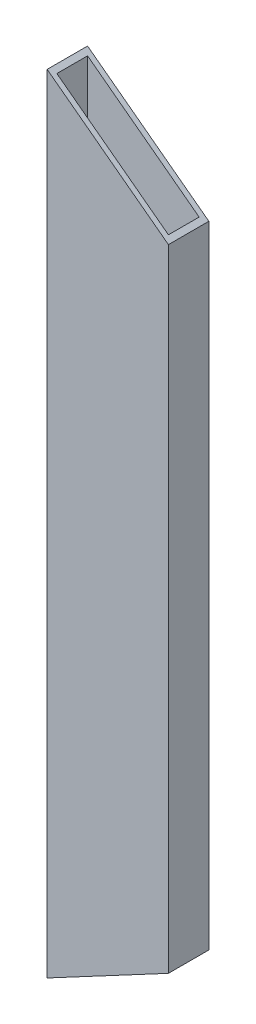
ISO-10303-21;
HEADER;
FILE_DESCRIPTION(('STEP AP214'),'2;1');
FILE_NAME('part.step','',(''),(''),'','','');
FILE_SCHEMA(('AUTOMOTIVE_DESIGN { 1 0 10303 214 1 1 1 1 }'));
ENDSEC;
DATA;
#1=APPLICATION_CONTEXT('core data for automotive mechanical design processes');
#2=APPLICATION_PROTOCOL_DEFINITION('international standard','automotive_design',2000,#1);
#3=PRODUCT_CONTEXT('',#1,'mechanical');
#4=PRODUCT('Part','Part','',(#3));
#5=PRODUCT_RELATED_PRODUCT_CATEGORY('part','',(#4));
#6=PRODUCT_DEFINITION_FORMATION('','',#4);
#7=PRODUCT_DEFINITION_CONTEXT('part definition',#1,'design');
#8=PRODUCT_DEFINITION('design','',#6,#7);
#9=PRODUCT_DEFINITION_SHAPE('','',#8);
#10=(LENGTH_UNIT() NAMED_UNIT(*) SI_UNIT(.MILLI.,.METRE.));
#11=(NAMED_UNIT(*) PLANE_ANGLE_UNIT() SI_UNIT($,.RADIAN.));
#12=(NAMED_UNIT(*) SI_UNIT($,.STERADIAN.) SOLID_ANGLE_UNIT());
#13=UNCERTAINTY_MEASURE_WITH_UNIT(LENGTH_MEASURE(1.E-05),#10,'distance_accuracy_value','');
#14=(GEOMETRIC_REPRESENTATION_CONTEXT(3) GLOBAL_UNCERTAINTY_ASSIGNED_CONTEXT((#13)) GLOBAL_UNIT_ASSIGNED_CONTEXT((#10,
#11,#12)) REPRESENTATION_CONTEXT('',''));
#15=CARTESIAN_POINT('',(0.,0.,0.));
#16=DIRECTION('',(0.,0.,1.));
#17=DIRECTION('',(1.,0.,0.));
#18=AXIS2_PLACEMENT_3D('',#15,#16,#17);
#19=CARTESIAN_POINT('',(-38.1,536.341159245056,-12.7));
#20=DIRECTION('',(1.,0.,0.));
#21=DIRECTION('',(0.,0.,-1.));
#22=AXIS2_PLACEMENT_3D('',#19,#20,#21);
#23=PLANE('',#22);
#24=DIRECTION('',(0.,-1.,0.));
#25=VECTOR('',#24,1.);
#26=CARTESIAN_POINT('',(-38.1,536.341159245056,-12.7));
#27=LINE('',#26,#25);
#28=CARTESIAN_POINT('',(-38.1,517.316735070927,-12.7));
#29=VERTEX_POINT('',#28);
#30=CARTESIAN_POINT('',(-38.1,22.8617814721548,-12.7));
#31=VERTEX_POINT('',#30);
#32=EDGE_CURVE('E113',#29,#31,#27,.T.);
#33=ORIENTED_EDGE('',*,*,#32,.T.);
#34=DIRECTION('',(0.,0.,1.));
#35=VECTOR('',#34,1.);
#36=CARTESIAN_POINT('',(-38.1,22.8617814721548,-12.6999999999999));
#37=LINE('',#36,#35);
#38=CARTESIAN_POINT('',(-38.1,22.8617814721548,12.7));
#39=VERTEX_POINT('',#38);
#40=EDGE_CURVE('E50',#31,#39,#37,.T.);
#41=ORIENTED_EDGE('',*,*,#40,.T.);
#42=DIRECTION('',(0.,-1.,0.));
#43=VECTOR('',#42,1.);
#44=CARTESIAN_POINT('',(-38.1,536.341159245056,12.7));
#45=LINE('',#44,#43);
#46=CARTESIAN_POINT('',(-38.1,517.316735070927,12.7));
#47=VERTEX_POINT('',#46);
#48=EDGE_CURVE('E111',#47,#39,#45,.T.);
#49=ORIENTED_EDGE('',*,*,#48,.F.);
#50=DIRECTION('',(0.,0.,-1.));
#51=VECTOR('',#50,1.);
#52=CARTESIAN_POINT('',(-38.1,517.316735070927,-12.7));
#53=LINE('',#52,#51);
#54=EDGE_CURVE('E139',#47,#29,#53,.T.);
#55=ORIENTED_EDGE('',*,*,#54,.T.);
#56=EDGE_LOOP('',(#33,#41,#49,#55));
#57=FACE_BOUND('',#56,.T.);
#58=ADVANCED_FACE('F36',(#57),#23,.F.);
#59=CARTESIAN_POINT('',(-38.1,536.341159245056,12.7));
#60=DIRECTION('',(0.,0.,-1.));
#61=DIRECTION('',(-1.,0.,0.));
#62=AXIS2_PLACEMENT_3D('',#59,#60,#61);
#63=PLANE('',#62);
#64=ORIENTED_EDGE('',*,*,#48,.T.);
#65=DIRECTION('',(0.882385296761728,0.470527563548318,0.));
#66=VECTOR('',#65,1.);
#67=CARTESIAN_POINT('',(-87.3188564866453,-3.38392854623099,12.7));
#68=LINE('',#67,#66);
#69=CARTESIAN_POINT('',(38.1,63.4950518518443,12.7));
#70=VERTEX_POINT('',#69);
#71=EDGE_CURVE('E97',#39,#70,#68,.T.);
#72=ORIENTED_EDGE('',*,*,#71,.T.);
#73=DIRECTION('',(0.,-1.,0.));
#74=VECTOR('',#73,1.);
#75=CARTESIAN_POINT('',(38.1,536.341159245056,12.7));
#76=LINE('',#75,#74);
#77=CARTESIAN_POINT('',(38.1,460.038718408292,12.7));
#78=VERTEX_POINT('',#77);
#79=EDGE_CURVE('E119',#78,#70,#76,.T.);
#80=ORIENTED_EDGE('',*,*,#79,.F.);
#81=DIRECTION('',(0.799354935162214,-0.600859124613925,0.));
#82=VECTOR('',#81,1.);
#83=CARTESIAN_POINT('',(-147.887614777533,599.841890301616,12.7));
#84=LINE('',#83,#82);
#85=EDGE_CURVE('E118',#47,#78,#84,.T.);
#86=ORIENTED_EDGE('',*,*,#85,.F.);
#87=EDGE_LOOP('',(#64,#72,#80,#86));
#88=FACE_BOUND('',#87,.T.);
#89=ADVANCED_FACE('F117',(#88),#63,.F.);
#90=CARTESIAN_POINT('',(38.1,536.341159245056,-12.7));
#91=DIRECTION('',(-1.,0.,0.));
#92=DIRECTION('',(0.,0.,1.));
#93=AXIS2_PLACEMENT_3D('',#90,#91,#92);
#94=PLANE('',#93);
#95=ORIENTED_EDGE('',*,*,#79,.T.);
#96=DIRECTION('',(0.,0.,-1.));
#97=VECTOR('',#96,1.);
#98=CARTESIAN_POINT('',(38.1,63.4950518518442,-12.6999999999999));
#99=LINE('',#98,#97);
#100=CARTESIAN_POINT('',(38.1,63.4950518518443,-12.7));
#101=VERTEX_POINT('',#100);
#102=EDGE_CURVE('E100',#70,#101,#99,.T.);
#103=ORIENTED_EDGE('',*,*,#102,.T.);
#104=DIRECTION('',(0.,-1.,0.));
#105=VECTOR('',#104,1.);
#106=CARTESIAN_POINT('',(38.1,536.341159245056,-12.7));
#107=LINE('',#106,#105);
#108=CARTESIAN_POINT('',(38.1,460.038718408292,-12.7));
#109=VERTEX_POINT('',#108);
#110=EDGE_CURVE('E121',#109,#101,#107,.T.);
#111=ORIENTED_EDGE('',*,*,#110,.F.);
#112=DIRECTION('',(0.,0.,1.));
#113=VECTOR('',#112,1.);
#114=CARTESIAN_POINT('',(38.1,460.038718408292,-12.7));
#115=LINE('',#114,#113);
#116=EDGE_CURVE('E141',#109,#78,#115,.T.);
#117=ORIENTED_EDGE('',*,*,#116,.T.);
#118=EDGE_LOOP('',(#95,#103,#111,#117));
#119=FACE_BOUND('',#118,.T.);
#120=ADVANCED_FACE('F162',(#119),#94,.F.);
#121=CARTESIAN_POINT('',(-38.1,536.341159245056,-12.7));
#122=DIRECTION('',(0.,0.,1.));
#123=DIRECTION('',(1.,0.,0.));
#124=AXIS2_PLACEMENT_3D('',#121,#122,#123);
#125=PLANE('',#124);
#126=ORIENTED_EDGE('',*,*,#110,.T.);
#127=DIRECTION('',(0.882385296761728,0.470527563548318,0.));
#128=VECTOR('',#127,1.);
#129=CARTESIAN_POINT('',(-87.3188564866453,-3.38392854623099,-12.7));
#130=LINE('',#129,#128);
#131=EDGE_CURVE('E105',#31,#101,#130,.T.);
#132=ORIENTED_EDGE('',*,*,#131,.F.);
#133=ORIENTED_EDGE('',*,*,#32,.F.);
#134=DIRECTION('',(0.799354935162214,-0.600859124613925,0.));
#135=VECTOR('',#134,1.);
#136=CARTESIAN_POINT('',(-147.887614777533,599.841890301616,-12.7));
#137=LINE('',#136,#135);
#138=EDGE_CURVE('E114',#29,#109,#137,.T.);
#139=ORIENTED_EDGE('',*,*,#138,.T.);
#140=EDGE_LOOP('',(#126,#132,#133,#139));
#141=FACE_BOUND('',#140,.T.);
#142=ADVANCED_FACE('F163',(#141),#125,.F.);
#143=CARTESIAN_POINT('',(-35.052,536.341159245056,-9.65199999999999));
#144=DIRECTION('',(1.,0.,0.));
#145=DIRECTION('',(0.,0.,-1.));
#146=AXIS2_PLACEMENT_3D('',#143,#144,#145);
#147=PLANE('',#146);
#148=DIRECTION('',(0.,0.,1.));
#149=VECTOR('',#148,1.);
#150=CARTESIAN_POINT('',(-35.052,24.4871122873423,-9.65199999999981));
#151=LINE('',#150,#149);
#152=CARTESIAN_POINT('',(-35.052,24.4871122873424,-9.65199999999999));
#153=VERTEX_POINT('',#152);
#154=CARTESIAN_POINT('',(-35.052,24.4871122873424,9.652));
#155=VERTEX_POINT('',#154);
#156=EDGE_CURVE('E154',#153,#155,#151,.T.);
#157=ORIENTED_EDGE('',*,*,#156,.F.);
#158=DIRECTION('',(0.,-1.,0.));
#159=VECTOR('',#158,1.);
#160=CARTESIAN_POINT('',(-35.052,536.341159245056,-9.65199999999999));
#161=LINE('',#160,#159);
#162=CARTESIAN_POINT('',(-35.052,515.025614404422,-9.65199999999999));
#163=VERTEX_POINT('',#162);
#164=EDGE_CURVE('E136',#163,#153,#161,.T.);
#165=ORIENTED_EDGE('',*,*,#164,.F.);
#166=DIRECTION('',(0.,0.,-1.));
#167=VECTOR('',#166,1.);
#168=CARTESIAN_POINT('',(-35.052,515.025614404422,-9.65199999999999));
#169=LINE('',#168,#167);
#170=CARTESIAN_POINT('',(-35.052,515.025614404422,9.652));
#171=VERTEX_POINT('',#170);
#172=EDGE_CURVE('E144',#171,#163,#169,.T.);
#173=ORIENTED_EDGE('',*,*,#172,.F.);
#174=DIRECTION('',(0.,-1.,0.));
#175=VECTOR('',#174,1.);
#176=CARTESIAN_POINT('',(-35.052,536.341159245056,9.652));
#177=LINE('',#176,#175);
#178=EDGE_CURVE('E127',#171,#155,#177,.T.);
#179=ORIENTED_EDGE('',*,*,#178,.T.);
#180=EDGE_LOOP('',(#157,#165,#173,#179));
#181=FACE_BOUND('',#180,.T.);
#182=ADVANCED_FACE('F189',(#181),#147,.T.);
#183=CARTESIAN_POINT('',(-35.052,536.341159245056,9.652));
#184=DIRECTION('',(0.,0.,-1.));
#185=DIRECTION('',(-1.,0.,0.));
#186=AXIS2_PLACEMENT_3D('',#183,#184,#185);
#187=PLANE('',#186);
#188=DIRECTION('',(0.882385296761728,0.470527563548318,0.));
#189=VECTOR('',#188,1.);
#190=CARTESIAN_POINT('',(177.462943395691,137.809647126208,9.65199999999997));
#191=LINE('',#190,#189);
#192=CARTESIAN_POINT('',(35.052,61.8697210366567,9.65199999999999));
#193=VERTEX_POINT('',#192);
#194=EDGE_CURVE('E156',#155,#193,#191,.T.);
#195=ORIENTED_EDGE('',*,*,#194,.F.);
#196=ORIENTED_EDGE('',*,*,#178,.F.);
#197=DIRECTION('',(-0.799354935162214,0.600859124613925,0.));
#198=VECTOR('',#197,1.);
#199=CARTESIAN_POINT('',(-45.2898499329203,522.721201531028,9.652));
#200=LINE('',#199,#198);
#201=CARTESIAN_POINT('',(35.052,462.329839074797,9.65199999999999));
#202=VERTEX_POINT('',#201);
#203=EDGE_CURVE('E146',#202,#171,#200,.T.);
#204=ORIENTED_EDGE('',*,*,#203,.F.);
#205=DIRECTION('',(0.,-1.,0.));
#206=VECTOR('',#205,1.);
#207=CARTESIAN_POINT('',(35.052,536.341159245056,9.65199999999999));
#208=LINE('',#207,#206);
#209=EDGE_CURVE('E130',#202,#193,#208,.T.);
#210=ORIENTED_EDGE('',*,*,#209,.T.);
#211=EDGE_LOOP('',(#195,#196,#204,#210));
#212=FACE_BOUND('',#211,.T.);
#213=ADVANCED_FACE('F192',(#212),#187,.T.);
#214=CARTESIAN_POINT('',(35.052,536.341159245056,-9.652));
#215=DIRECTION('',(-1.,0.,0.));
#216=DIRECTION('',(0.,0.,1.));
#217=AXIS2_PLACEMENT_3D('',#214,#215,#216);
#218=PLANE('',#217);
#219=DIRECTION('',(0.,0.,-1.));
#220=VECTOR('',#219,1.);
#221=CARTESIAN_POINT('',(35.052,61.8697210366567,-9.65199999999983));
#222=LINE('',#221,#220);
#223=CARTESIAN_POINT('',(35.052,61.8697210366567,-9.652));
#224=VERTEX_POINT('',#223);
#225=EDGE_CURVE('E57',#193,#224,#222,.T.);
#226=ORIENTED_EDGE('',*,*,#225,.F.);
#227=ORIENTED_EDGE('',*,*,#209,.F.);
#228=DIRECTION('',(0.,0.,1.));
#229=VECTOR('',#228,1.);
#230=CARTESIAN_POINT('',(35.052,462.329839074797,-9.65199999999999));
#231=LINE('',#230,#229);
#232=CARTESIAN_POINT('',(35.052,462.329839074797,-9.652));
#233=VERTEX_POINT('',#232);
#234=EDGE_CURVE('E148',#233,#202,#231,.T.);
#235=ORIENTED_EDGE('',*,*,#234,.F.);
#236=DIRECTION('',(0.,-1.,0.));
#237=VECTOR('',#236,1.);
#238=CARTESIAN_POINT('',(35.052,536.341159245056,-9.652));
#239=LINE('',#238,#237);
#240=EDGE_CURVE('E133',#233,#224,#239,.T.);
#241=ORIENTED_EDGE('',*,*,#240,.T.);
#242=EDGE_LOOP('',(#226,#227,#235,#241));
#243=FACE_BOUND('',#242,.T.);
#244=ADVANCED_FACE('F175',(#243),#218,.T.);
#245=CARTESIAN_POINT('',(-35.052,536.341159245056,-9.65199999999999));
#246=DIRECTION('',(0.,0.,1.));
#247=DIRECTION('',(1.,0.,0.));
#248=AXIS2_PLACEMENT_3D('',#245,#246,#247);
#249=PLANE('',#248);
#250=DIRECTION('',(-0.882385296761728,-0.470527563548318,0.));
#251=VECTOR('',#250,1.);
#252=CARTESIAN_POINT('',(177.462943395691,137.809647126208,-9.65200000000002));
#253=LINE('',#252,#251);
#254=EDGE_CURVE('E11',#224,#153,#253,.T.);
#255=ORIENTED_EDGE('',*,*,#254,.F.);
#256=ORIENTED_EDGE('',*,*,#240,.F.);
#257=DIRECTION('',(0.799354935162214,-0.600859124613925,0.));
#258=VECTOR('',#257,1.);
#259=CARTESIAN_POINT('',(-45.2898499329203,522.721201531028,-9.65199999999999));
#260=LINE('',#259,#258);
#261=EDGE_CURVE('E43',#163,#233,#260,.T.);
#262=ORIENTED_EDGE('',*,*,#261,.F.);
#263=ORIENTED_EDGE('',*,*,#164,.T.);
#264=EDGE_LOOP('',(#255,#256,#262,#263));
#265=FACE_BOUND('',#264,.T.);
#266=ADVANCED_FACE('F167',(#265),#249,.T.);
#267=CARTESIAN_POINT('',(-147.887614777533,599.841890301616,-12.7));
#268=DIRECTION('',(-0.600859124613925,-0.799354935162214,0.));
#269=DIRECTION('',(0.799354935162214,-0.600859124613925,0.));
#270=AXIS2_PLACEMENT_3D('',#267,#268,#269);
#271=PLANE('',#270);
#272=ORIENTED_EDGE('',*,*,#172,.T.);
#273=ORIENTED_EDGE('',*,*,#261,.T.);
#274=ORIENTED_EDGE('',*,*,#234,.T.);
#275=ORIENTED_EDGE('',*,*,#203,.T.);
#276=EDGE_LOOP('',(#272,#273,#274,#275));
#277=FACE_BOUND('',#276,.T.);
#278=ORIENTED_EDGE('',*,*,#85,.T.);
#279=ORIENTED_EDGE('',*,*,#116,.F.);
#280=ORIENTED_EDGE('',*,*,#138,.F.);
#281=ORIENTED_EDGE('',*,*,#54,.F.);
#282=EDGE_LOOP('',(#278,#279,#280,#281));
#283=FACE_BOUND('',#282,.T.);
#284=ADVANCED_FACE('F165',(#277,#283),#271,.F.);
#285=CARTESIAN_POINT('',(-87.3188564866453,-3.38392854623099,-12.7));
#286=DIRECTION('',(-0.470527563548318,0.882385296761728,0.));
#287=DIRECTION('',(-0.882385296761728,-0.470527563548318,0.));
#288=AXIS2_PLACEMENT_3D('',#285,#286,#287);
#289=PLANE('',#288);
#290=ORIENTED_EDGE('',*,*,#156,.T.);
#291=ORIENTED_EDGE('',*,*,#194,.T.);
#292=ORIENTED_EDGE('',*,*,#225,.T.);
#293=ORIENTED_EDGE('',*,*,#254,.T.);
#294=EDGE_LOOP('',(#290,#291,#292,#293));
#295=FACE_BOUND('',#294,.T.);
#296=ORIENTED_EDGE('',*,*,#131,.T.);
#297=ORIENTED_EDGE('',*,*,#102,.F.);
#298=ORIENTED_EDGE('',*,*,#71,.F.);
#299=ORIENTED_EDGE('',*,*,#40,.F.);
#300=EDGE_LOOP('',(#296,#297,#298,#299));
#301=FACE_BOUND('',#300,.T.);
#302=ADVANCED_FACE('F98',(#295,#301),#289,.F.);
#303=CLOSED_SHELL('',(#58,#89,#120,#142,#182,#213,#244,#266,#284,#302));
#304=MANIFOLD_SOLID_BREP('B2',#303);
#305=ADVANCED_BREP_SHAPE_REPRESENTATION('',(#18,#304),#14);
#306=SHAPE_DEFINITION_REPRESENTATION(#9,#305);
ENDSEC;
END-ISO-10303-21;
